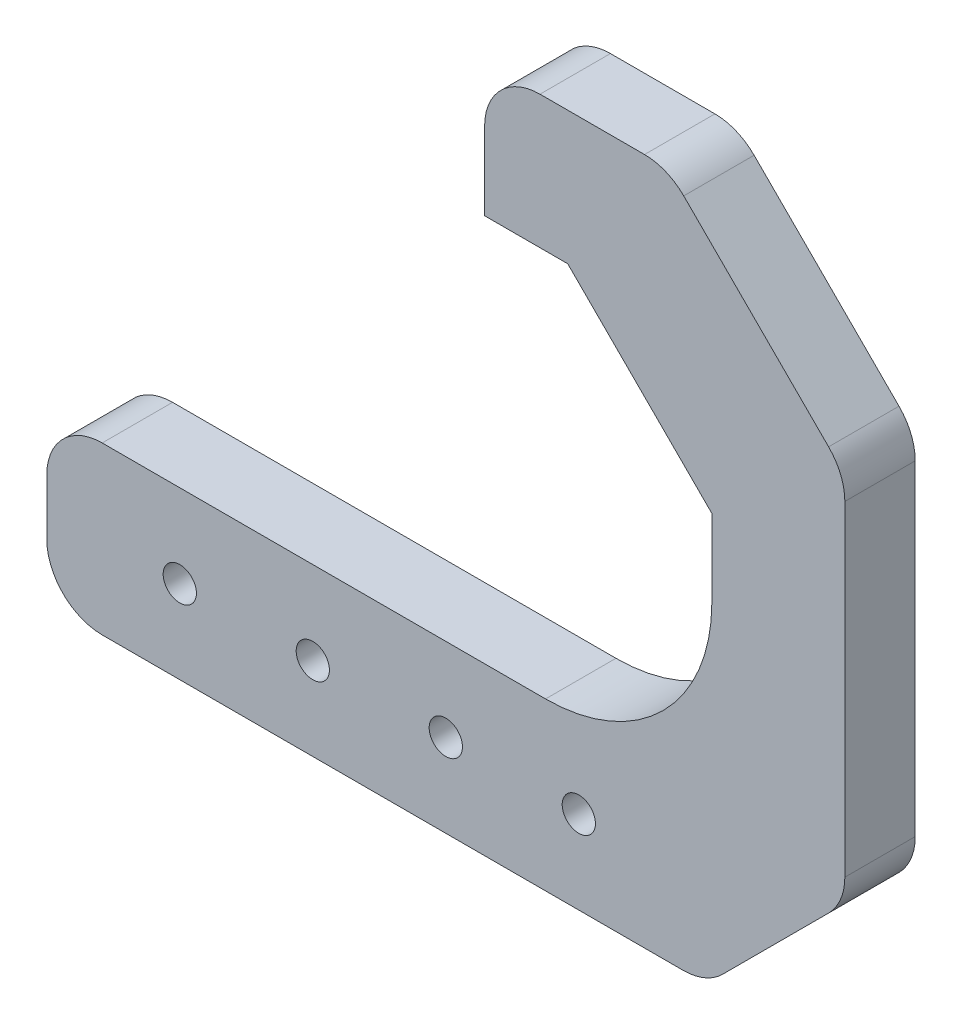
ISO-10303-21;
HEADER;
FILE_DESCRIPTION(('STEP AP214'),'2;1');
FILE_NAME('part.step','',(''),(''),'','','');
FILE_SCHEMA(('AUTOMOTIVE_DESIGN { 1 0 10303 214 1 1 1 1 }'));
ENDSEC;
DATA;
#1=APPLICATION_CONTEXT('core data for automotive mechanical design processes');
#2=APPLICATION_PROTOCOL_DEFINITION('international standard','automotive_design',2000,#1);
#3=PRODUCT_CONTEXT('',#1,'mechanical');
#4=PRODUCT('Part','Part','',(#3));
#5=PRODUCT_RELATED_PRODUCT_CATEGORY('part','',(#4));
#6=PRODUCT_DEFINITION_FORMATION('','',#4);
#7=PRODUCT_DEFINITION_CONTEXT('part definition',#1,'design');
#8=PRODUCT_DEFINITION('design','',#6,#7);
#9=PRODUCT_DEFINITION_SHAPE('','',#8);
#10=(LENGTH_UNIT() NAMED_UNIT(*) SI_UNIT(.MILLI.,.METRE.));
#11=(NAMED_UNIT(*) PLANE_ANGLE_UNIT() SI_UNIT($,.RADIAN.));
#12=(NAMED_UNIT(*) SI_UNIT($,.STERADIAN.) SOLID_ANGLE_UNIT());
#13=UNCERTAINTY_MEASURE_WITH_UNIT(LENGTH_MEASURE(1.E-05),#10,'distance_accuracy_value','');
#14=(GEOMETRIC_REPRESENTATION_CONTEXT(3) GLOBAL_UNCERTAINTY_ASSIGNED_CONTEXT((#13)) GLOBAL_UNIT_ASSIGNED_CONTEXT((#10,
#11,#12)) REPRESENTATION_CONTEXT('',''));
#15=CARTESIAN_POINT('',(0.,0.,0.));
#16=DIRECTION('',(0.,0.,1.));
#17=DIRECTION('',(1.,0.,0.));
#18=AXIS2_PLACEMENT_3D('',#15,#16,#17);
#19=CARTESIAN_POINT('',(0.,0.,6.35));
#20=DIRECTION('',(0.,1.,0.));
#21=DIRECTION('',(0.,0.,1.));
#22=AXIS2_PLACEMENT_3D('',#19,#20,#21);
#23=PLANE('',#22);
#24=DIRECTION('',(1.,0.,0.));
#25=VECTOR('',#24,1.);
#26=CARTESIAN_POINT('',(0.,0.,6.35));
#27=LINE('',#26,#25);
#28=CARTESIAN_POINT('',(5.,0.,6.35));
#29=VERTEX_POINT('',#28);
#30=CARTESIAN_POINT('',(57.4289321881345,0.,6.35));
#31=VERTEX_POINT('',#30);
#32=EDGE_CURVE('E392',#29,#31,#27,.T.);
#33=ORIENTED_EDGE('',*,*,#32,.F.);
#34=DIRECTION('',(0.,0.,-1.));
#35=VECTOR('',#34,1.);
#36=CARTESIAN_POINT('',(5.,0.,0.));
#37=LINE('',#36,#35);
#38=CARTESIAN_POINT('',(5.,0.,0.));
#39=VERTEX_POINT('',#38);
#40=EDGE_CURVE('E11',#29,#39,#37,.T.);
#41=ORIENTED_EDGE('',*,*,#40,.T.);
#42=DIRECTION('',(1.,0.,0.));
#43=VECTOR('',#42,1.);
#44=CARTESIAN_POINT('',(0.,0.,0.));
#45=LINE('',#44,#43);
#46=CARTESIAN_POINT('',(57.4289321881345,0.,0.));
#47=VERTEX_POINT('',#46);
#48=EDGE_CURVE('E220',#39,#47,#45,.T.);
#49=ORIENTED_EDGE('',*,*,#48,.T.);
#50=DIRECTION('',(0.,0.,-1.));
#51=VECTOR('',#50,1.);
#52=CARTESIAN_POINT('',(57.4289321881345,0.,6.35));
#53=LINE('',#52,#51);
#54=EDGE_CURVE('E277',#47,#31,#53,.F.);
#55=ORIENTED_EDGE('',*,*,#54,.T.);
#56=EDGE_LOOP('',(#33,#41,#49,#55));
#57=FACE_BOUND('',#56,.T.);
#58=ADVANCED_FACE('F37',(#57),#23,.F.);
#59=CARTESIAN_POINT('',(72.,0.,6.35));
#60=DIRECTION('',(-1.,0.,0.));
#61=DIRECTION('',(0.,0.,1.));
#62=AXIS2_PLACEMENT_3D('',#59,#60,#61);
#63=PLANE('',#62);
#64=DIRECTION('',(0.,1.,0.));
#65=VECTOR('',#64,1.);
#66=CARTESIAN_POINT('',(72.,0.,6.35));
#67=LINE('',#66,#65);
#68=CARTESIAN_POINT('',(72.,14.5710678118655,6.35));
#69=VERTEX_POINT('',#68);
#70=CARTESIAN_POINT('',(72.,43.9289321881345,6.35));
#71=VERTEX_POINT('',#70);
#72=EDGE_CURVE('E198',#69,#71,#67,.T.);
#73=ORIENTED_EDGE('',*,*,#72,.F.);
#74=DIRECTION('',(0.,0.,1.));
#75=VECTOR('',#74,1.);
#76=CARTESIAN_POINT('',(72.,14.5710678118655,0.));
#77=LINE('',#76,#75);
#78=CARTESIAN_POINT('',(72.,14.5710678118655,0.));
#79=VERTEX_POINT('',#78);
#80=EDGE_CURVE('E304',#69,#79,#77,.F.);
#81=ORIENTED_EDGE('',*,*,#80,.T.);
#82=DIRECTION('',(0.,1.,0.));
#83=VECTOR('',#82,1.);
#84=CARTESIAN_POINT('',(72.,0.,0.));
#85=LINE('',#84,#83);
#86=CARTESIAN_POINT('',(72.,43.9289321881345,0.));
#87=VERTEX_POINT('',#86);
#88=EDGE_CURVE('E222',#79,#87,#85,.T.);
#89=ORIENTED_EDGE('',*,*,#88,.T.);
#90=DIRECTION('',(0.,0.,-1.));
#91=VECTOR('',#90,1.);
#92=CARTESIAN_POINT('',(72.,43.9289321881345,6.35));
#93=LINE('',#92,#91);
#94=EDGE_CURVE('E301',#87,#71,#93,.F.);
#95=ORIENTED_EDGE('',*,*,#94,.T.);
#96=EDGE_LOOP('',(#73,#81,#89,#95));
#97=FACE_BOUND('',#96,.T.);
#98=ADVANCED_FACE('F372',(#97),#63,.F.);
#99=CARTESIAN_POINT('',(0.,62.,6.35));
#100=DIRECTION('',(0.,-1.,0.));
#101=DIRECTION('',(1.,0.,0.));
#102=AXIS2_PLACEMENT_3D('',#99,#100,#101);
#103=PLANE('',#102);
#104=DIRECTION('',(-1.,0.,0.));
#105=VECTOR('',#104,1.);
#106=CARTESIAN_POINT('',(0.,62.,6.35));
#107=LINE('',#106,#105);
#108=CARTESIAN_POINT('',(53.9289321881345,62.,6.35));
#109=VERTEX_POINT('',#108);
#110=CARTESIAN_POINT('',(44.5,62.,6.35));
#111=VERTEX_POINT('',#110);
#112=EDGE_CURVE('E196',#109,#111,#107,.T.);
#113=ORIENTED_EDGE('',*,*,#112,.F.);
#114=DIRECTION('',(0.,0.,1.));
#115=VECTOR('',#114,1.);
#116=CARTESIAN_POINT('',(53.9289321881345,62.,0.));
#117=LINE('',#116,#115);
#118=CARTESIAN_POINT('',(53.9289321881345,62.,0.));
#119=VERTEX_POINT('',#118);
#120=EDGE_CURVE('E311',#109,#119,#117,.F.);
#121=ORIENTED_EDGE('',*,*,#120,.T.);
#122=DIRECTION('',(-1.,0.,0.));
#123=VECTOR('',#122,1.);
#124=CARTESIAN_POINT('',(0.,62.,0.));
#125=LINE('',#124,#123);
#126=CARTESIAN_POINT('',(44.5,62.,0.));
#127=VERTEX_POINT('',#126);
#128=EDGE_CURVE('E225',#119,#127,#125,.T.);
#129=ORIENTED_EDGE('',*,*,#128,.T.);
#130=DIRECTION('',(0.,0.,-1.));
#131=VECTOR('',#130,1.);
#132=CARTESIAN_POINT('',(44.5,62.,6.35));
#133=LINE('',#132,#131);
#134=EDGE_CURVE('E261',#127,#111,#133,.F.);
#135=ORIENTED_EDGE('',*,*,#134,.T.);
#136=EDGE_LOOP('',(#113,#121,#129,#135));
#137=FACE_BOUND('',#136,.T.);
#138=ADVANCED_FACE('F354',(#137),#103,.F.);
#139=CARTESIAN_POINT('',(39.5,0.,6.35));
#140=DIRECTION('',(-1.,0.,0.));
#141=DIRECTION('',(0.,0.,1.));
#142=AXIS2_PLACEMENT_3D('',#139,#140,#141);
#143=PLANE('',#142);
#144=DIRECTION('',(0.,1.,0.));
#145=VECTOR('',#144,1.);
#146=CARTESIAN_POINT('',(39.5,0.,6.35));
#147=LINE('',#146,#145);
#148=CARTESIAN_POINT('',(39.5,50.,6.35));
#149=VERTEX_POINT('',#148);
#150=CARTESIAN_POINT('',(39.5,57.,6.35));
#151=VERTEX_POINT('',#150);
#152=EDGE_CURVE('E181',#149,#151,#147,.T.);
#153=ORIENTED_EDGE('',*,*,#152,.T.);
#154=DIRECTION('',(0.,0.,-1.));
#155=VECTOR('',#154,1.);
#156=CARTESIAN_POINT('',(39.5,57.,0.));
#157=LINE('',#156,#155);
#158=CARTESIAN_POINT('',(39.5,57.,0.));
#159=VERTEX_POINT('',#158);
#160=EDGE_CURVE('E256',#151,#159,#157,.T.);
#161=ORIENTED_EDGE('',*,*,#160,.T.);
#162=DIRECTION('',(0.,1.,0.));
#163=VECTOR('',#162,1.);
#164=CARTESIAN_POINT('',(39.5,0.,0.));
#165=LINE('',#164,#163);
#166=CARTESIAN_POINT('',(39.5,50.,0.));
#167=VERTEX_POINT('',#166);
#168=EDGE_CURVE('E189',#167,#159,#165,.T.);
#169=ORIENTED_EDGE('',*,*,#168,.F.);
#170=DIRECTION('',(0.,0.,-1.));
#171=VECTOR('',#170,1.);
#172=CARTESIAN_POINT('',(39.5,50.,6.35));
#173=LINE('',#172,#171);
#174=EDGE_CURVE('E174',#149,#167,#173,.T.);
#175=ORIENTED_EDGE('',*,*,#174,.F.);
#176=EDGE_LOOP('',(#153,#161,#169,#175));
#177=FACE_BOUND('',#176,.T.);
#178=ADVANCED_FACE('F185',(#177),#143,.T.);
#179=CARTESIAN_POINT('',(0.,50.,6.35));
#180=DIRECTION('',(0.,-1.,0.));
#181=DIRECTION('',(1.,0.,0.));
#182=AXIS2_PLACEMENT_3D('',#179,#180,#181);
#183=PLANE('',#182);
#184=DIRECTION('',(-1.,0.,0.));
#185=VECTOR('',#184,1.);
#186=CARTESIAN_POINT('',(0.,50.,0.));
#187=LINE('',#186,#185);
#188=CARTESIAN_POINT('',(47.0000000000001,50.,0.));
#189=VERTEX_POINT('',#188);
#190=EDGE_CURVE('E228',#189,#167,#187,.T.);
#191=ORIENTED_EDGE('',*,*,#190,.F.);
#192=DIRECTION('',(0.,0.,1.));
#193=VECTOR('',#192,1.);
#194=CARTESIAN_POINT('',(47.0000000000001,50.,6.35));
#195=LINE('',#194,#193);
#196=CARTESIAN_POINT('',(47.0000000000001,50.,6.35));
#197=VERTEX_POINT('',#196);
#198=EDGE_CURVE('E177',#189,#197,#195,.T.);
#199=ORIENTED_EDGE('',*,*,#198,.T.);
#200=DIRECTION('',(-1.,0.,0.));
#201=VECTOR('',#200,1.);
#202=CARTESIAN_POINT('',(0.,50.,6.35));
#203=LINE('',#202,#201);
#204=EDGE_CURVE('E170',#197,#149,#203,.T.);
#205=ORIENTED_EDGE('',*,*,#204,.T.);
#206=ORIENTED_EDGE('',*,*,#174,.T.);
#207=EDGE_LOOP('',(#191,#199,#205,#206));
#208=FACE_BOUND('',#207,.T.);
#209=ADVANCED_FACE('F173',(#208),#183,.T.);
#210=CARTESIAN_POINT('',(60.,0.,6.35));
#211=DIRECTION('',(-1.,0.,0.));
#212=DIRECTION('',(0.,0.,1.));
#213=AXIS2_PLACEMENT_3D('',#210,#211,#212);
#214=PLANE('',#213);
#215=DIRECTION('',(0.,1.,0.));
#216=VECTOR('',#215,1.);
#217=CARTESIAN_POINT('',(60.,0.,6.35));
#218=LINE('',#217,#216);
#219=CARTESIAN_POINT('',(60.,30.,6.35));
#220=VERTEX_POINT('',#219);
#221=CARTESIAN_POINT('',(60.,36.9999999999999,6.35));
#222=VERTEX_POINT('',#221);
#223=EDGE_CURVE('E180',#220,#222,#218,.T.);
#224=ORIENTED_EDGE('',*,*,#223,.T.);
#225=DIRECTION('',(0.,0.,-1.));
#226=VECTOR('',#225,1.);
#227=CARTESIAN_POINT('',(60.,36.9999999999999,0.));
#228=LINE('',#227,#226);
#229=CARTESIAN_POINT('',(60.,36.9999999999999,0.));
#230=VERTEX_POINT('',#229);
#231=EDGE_CURVE('E248',#222,#230,#228,.T.);
#232=ORIENTED_EDGE('',*,*,#231,.T.);
#233=DIRECTION('',(0.,1.,0.));
#234=VECTOR('',#233,1.);
#235=CARTESIAN_POINT('',(60.,0.,0.));
#236=LINE('',#235,#234);
#237=CARTESIAN_POINT('',(60.,30.,0.));
#238=VERTEX_POINT('',#237);
#239=EDGE_CURVE('E230',#238,#230,#236,.T.);
#240=ORIENTED_EDGE('',*,*,#239,.F.);
#241=DIRECTION('',(0.,0.,-1.));
#242=VECTOR('',#241,1.);
#243=CARTESIAN_POINT('',(60.,30.,6.35));
#244=LINE('',#243,#242);
#245=EDGE_CURVE('E241',#238,#220,#244,.F.);
#246=ORIENTED_EDGE('',*,*,#245,.T.);
#247=EDGE_LOOP('',(#224,#232,#240,#246));
#248=FACE_BOUND('',#247,.T.);
#249=ADVANCED_FACE('F343',(#248),#214,.T.);
#250=CARTESIAN_POINT('',(0.,15.,6.35));
#251=DIRECTION('',(0.,1.,0.));
#252=DIRECTION('',(0.,0.,1.));
#253=AXIS2_PLACEMENT_3D('',#250,#251,#252);
#254=PLANE('',#253);
#255=DIRECTION('',(1.,0.,0.));
#256=VECTOR('',#255,1.);
#257=CARTESIAN_POINT('',(0.,15.,0.));
#258=LINE('',#257,#256);
#259=CARTESIAN_POINT('',(5.,15.,0.));
#260=VERTEX_POINT('',#259);
#261=CARTESIAN_POINT('',(45.,15.,0.));
#262=VERTEX_POINT('',#261);
#263=EDGE_CURVE('E233',#260,#262,#258,.T.);
#264=ORIENTED_EDGE('',*,*,#263,.F.);
#265=DIRECTION('',(0.,0.,-1.));
#266=VECTOR('',#265,1.);
#267=CARTESIAN_POINT('',(5.,15.,6.35));
#268=LINE('',#267,#266);
#269=CARTESIAN_POINT('',(5.,15.,6.35));
#270=VERTEX_POINT('',#269);
#271=EDGE_CURVE('E60',#260,#270,#268,.F.);
#272=ORIENTED_EDGE('',*,*,#271,.T.);
#273=DIRECTION('',(1.,0.,0.));
#274=VECTOR('',#273,1.);
#275=CARTESIAN_POINT('',(0.,15.,6.35));
#276=LINE('',#275,#274);
#277=CARTESIAN_POINT('',(45.,15.,6.35));
#278=VERTEX_POINT('',#277);
#279=EDGE_CURVE('E204',#270,#278,#276,.T.);
#280=ORIENTED_EDGE('',*,*,#279,.T.);
#281=DIRECTION('',(0.,0.,-1.));
#282=VECTOR('',#281,1.);
#283=CARTESIAN_POINT('',(45.,15.,0.));
#284=LINE('',#283,#282);
#285=EDGE_CURVE('E190',#278,#262,#284,.T.);
#286=ORIENTED_EDGE('',*,*,#285,.T.);
#287=EDGE_LOOP('',(#264,#272,#280,#286));
#288=FACE_BOUND('',#287,.T.);
#289=ADVANCED_FACE('F335',(#288),#254,.T.);
#290=CARTESIAN_POINT('',(48.,7.5,6.35));
#291=DIRECTION('',(0.,0.,-1.));
#292=DIRECTION('',(-1.,0.,0.));
#293=AXIS2_PLACEMENT_3D('',#290,#291,#292);
#294=CYLINDRICAL_SURFACE('',#293,1.5);
#295=CARTESIAN_POINT('',(48.,7.5,6.35));
#296=DIRECTION('',(0.,0.,1.));
#297=DIRECTION('',(1.,0.,0.));
#298=AXIS2_PLACEMENT_3D('',#295,#296,#297);
#299=CIRCLE('',#298,1.5);
#300=CARTESIAN_POINT('',(49.5,7.5,6.35));
#301=VERTEX_POINT('',#300);
#302=EDGE_CURVE('E639',#301,#301,#299,.T.);
#303=ORIENTED_EDGE('',*,*,#302,.T.);
#304=EDGE_LOOP('',(#303));
#305=FACE_BOUND('',#304,.T.);
#306=CARTESIAN_POINT('',(48.,7.5,0.));
#307=DIRECTION('',(0.,0.,1.));
#308=DIRECTION('',(1.,0.,0.));
#309=AXIS2_PLACEMENT_3D('',#306,#307,#308);
#310=CIRCLE('',#309,1.5);
#311=CARTESIAN_POINT('',(49.5,7.5,0.));
#312=VERTEX_POINT('',#311);
#313=EDGE_CURVE('E217',#312,#312,#310,.T.);
#314=ORIENTED_EDGE('',*,*,#313,.F.);
#315=EDGE_LOOP('',(#314));
#316=FACE_BOUND('',#315,.T.);
#317=ADVANCED_FACE('F406',(#305,#316),#294,.F.);
#318=CARTESIAN_POINT('',(36.,7.49999999999992,6.35));
#319=DIRECTION('',(0.,0.,-1.));
#320=DIRECTION('',(-1.,0.,0.));
#321=AXIS2_PLACEMENT_3D('',#318,#319,#320);
#322=CYLINDRICAL_SURFACE('',#321,1.5);
#323=CARTESIAN_POINT('',(36.,7.49999999999992,6.35));
#324=DIRECTION('',(0.,0.,1.));
#325=DIRECTION('',(1.,0.,0.));
#326=AXIS2_PLACEMENT_3D('',#323,#324,#325);
#327=CIRCLE('',#326,1.5);
#328=CARTESIAN_POINT('',(37.5,7.49999999999992,6.35));
#329=VERTEX_POINT('',#328);
#330=EDGE_CURVE('E636',#329,#329,#327,.T.);
#331=ORIENTED_EDGE('',*,*,#330,.T.);
#332=EDGE_LOOP('',(#331));
#333=FACE_BOUND('',#332,.T.);
#334=CARTESIAN_POINT('',(36.,7.49999999999992,0.));
#335=DIRECTION('',(0.,0.,1.));
#336=DIRECTION('',(1.,0.,0.));
#337=AXIS2_PLACEMENT_3D('',#334,#335,#336);
#338=CIRCLE('',#337,1.5);
#339=CARTESIAN_POINT('',(37.5,7.49999999999992,0.));
#340=VERTEX_POINT('',#339);
#341=EDGE_CURVE('E214',#340,#340,#338,.T.);
#342=ORIENTED_EDGE('',*,*,#341,.F.);
#343=EDGE_LOOP('',(#342));
#344=FACE_BOUND('',#343,.T.);
#345=ADVANCED_FACE('F409',(#333,#344),#322,.F.);
#346=CARTESIAN_POINT('',(24.,7.49999999999983,6.35));
#347=DIRECTION('',(0.,0.,-1.));
#348=DIRECTION('',(-1.,0.,0.));
#349=AXIS2_PLACEMENT_3D('',#346,#347,#348);
#350=CYLINDRICAL_SURFACE('',#349,1.5);
#351=CARTESIAN_POINT('',(24.,7.49999999999983,6.35));
#352=DIRECTION('',(0.,0.,1.));
#353=DIRECTION('',(1.,0.,0.));
#354=AXIS2_PLACEMENT_3D('',#351,#352,#353);
#355=CIRCLE('',#354,1.5);
#356=CARTESIAN_POINT('',(25.5,7.49999999999983,6.35));
#357=VERTEX_POINT('',#356);
#358=EDGE_CURVE('E632',#357,#357,#355,.T.);
#359=ORIENTED_EDGE('',*,*,#358,.T.);
#360=EDGE_LOOP('',(#359));
#361=FACE_BOUND('',#360,.T.);
#362=CARTESIAN_POINT('',(24.,7.49999999999983,0.));
#363=DIRECTION('',(0.,0.,1.));
#364=DIRECTION('',(1.,0.,0.));
#365=AXIS2_PLACEMENT_3D('',#362,#363,#364);
#366=CIRCLE('',#365,1.5);
#367=CARTESIAN_POINT('',(25.5,7.49999999999983,0.));
#368=VERTEX_POINT('',#367);
#369=EDGE_CURVE('E211',#368,#368,#366,.T.);
#370=ORIENTED_EDGE('',*,*,#369,.F.);
#371=EDGE_LOOP('',(#370));
#372=FACE_BOUND('',#371,.T.);
#373=ADVANCED_FACE('F413',(#361,#372),#350,.F.);
#374=CARTESIAN_POINT('',(12.,7.49999999999975,6.35));
#375=DIRECTION('',(0.,0.,-1.));
#376=DIRECTION('',(-1.,0.,0.));
#377=AXIS2_PLACEMENT_3D('',#374,#375,#376);
#378=CYLINDRICAL_SURFACE('',#377,1.5);
#379=CARTESIAN_POINT('',(12.,7.49999999999975,6.35));
#380=DIRECTION('',(0.,0.,1.));
#381=DIRECTION('',(1.,0.,0.));
#382=AXIS2_PLACEMENT_3D('',#379,#380,#381);
#383=CIRCLE('',#382,1.5);
#384=CARTESIAN_POINT('',(13.5,7.49999999999975,6.35));
#385=VERTEX_POINT('',#384);
#386=EDGE_CURVE('E237',#385,#385,#383,.T.);
#387=ORIENTED_EDGE('',*,*,#386,.T.);
#388=EDGE_LOOP('',(#387));
#389=FACE_BOUND('',#388,.T.);
#390=CARTESIAN_POINT('',(12.,7.49999999999975,0.));
#391=DIRECTION('',(0.,0.,1.));
#392=DIRECTION('',(1.,0.,0.));
#393=AXIS2_PLACEMENT_3D('',#390,#391,#392);
#394=CIRCLE('',#393,1.5);
#395=CARTESIAN_POINT('',(13.5,7.49999999999975,0.));
#396=VERTEX_POINT('',#395);
#397=EDGE_CURVE('E208',#396,#396,#394,.T.);
#398=ORIENTED_EDGE('',*,*,#397,.F.);
#399=EDGE_LOOP('',(#398));
#400=FACE_BOUND('',#399,.T.);
#401=ADVANCED_FACE('F417',(#389,#400),#378,.F.);
#402=CARTESIAN_POINT('',(0.,0.,6.35));
#403=DIRECTION('',(-1.,0.,0.));
#404=DIRECTION('',(0.,0.,1.));
#405=AXIS2_PLACEMENT_3D('',#402,#403,#404);
#406=PLANE('',#405);
#407=DIRECTION('',(0.,1.,0.));
#408=VECTOR('',#407,1.);
#409=CARTESIAN_POINT('',(0.,0.,6.35));
#410=LINE('',#409,#408);
#411=CARTESIAN_POINT('',(0.,5.,6.35));
#412=VERTEX_POINT('',#411);
#413=CARTESIAN_POINT('',(0.,10.,6.35));
#414=VERTEX_POINT('',#413);
#415=EDGE_CURVE('E191',#412,#414,#410,.T.);
#416=ORIENTED_EDGE('',*,*,#415,.T.);
#417=DIRECTION('',(0.,0.,-1.));
#418=VECTOR('',#417,1.);
#419=CARTESIAN_POINT('',(0.,10.,6.35));
#420=LINE('',#419,#418);
#421=CARTESIAN_POINT('',(0.,10.,0.));
#422=VERTEX_POINT('',#421);
#423=EDGE_CURVE('E316',#414,#422,#420,.T.);
#424=ORIENTED_EDGE('',*,*,#423,.T.);
#425=DIRECTION('',(0.,1.,0.));
#426=VECTOR('',#425,1.);
#427=CARTESIAN_POINT('',(0.,0.,0.));
#428=LINE('',#427,#426);
#429=CARTESIAN_POINT('',(0.,5.,0.));
#430=VERTEX_POINT('',#429);
#431=EDGE_CURVE('E235',#430,#422,#428,.T.);
#432=ORIENTED_EDGE('',*,*,#431,.F.);
#433=DIRECTION('',(0.,0.,-1.));
#434=VECTOR('',#433,1.);
#435=CARTESIAN_POINT('',(0.,5.,6.35));
#436=LINE('',#435,#434);
#437=EDGE_CURVE('E314',#430,#412,#436,.F.);
#438=ORIENTED_EDGE('',*,*,#437,.T.);
#439=EDGE_LOOP('',(#416,#424,#432,#438));
#440=FACE_BOUND('',#439,.T.);
#441=ADVANCED_FACE('F328',(#440),#406,.T.);
#442=CARTESIAN_POINT('',(0.,0.,6.35));
#443=DIRECTION('',(0.,0.,1.));
#444=DIRECTION('',(1.,0.,0.));
#445=AXIS2_PLACEMENT_3D('',#442,#443,#444);
#446=PLANE('',#445);
#447=ORIENTED_EDGE('',*,*,#386,.F.);
#448=EDGE_LOOP('',(#447));
#449=FACE_BOUND('',#448,.T.);
#450=ORIENTED_EDGE('',*,*,#358,.F.);
#451=EDGE_LOOP('',(#450));
#452=FACE_BOUND('',#451,.T.);
#453=ORIENTED_EDGE('',*,*,#330,.F.);
#454=EDGE_LOOP('',(#453));
#455=FACE_BOUND('',#454,.T.);
#456=ORIENTED_EDGE('',*,*,#302,.F.);
#457=EDGE_LOOP('',(#456));
#458=FACE_BOUND('',#457,.T.);
#459=ORIENTED_EDGE('',*,*,#279,.F.);
#460=CARTESIAN_POINT('',(5.,10.,6.35));
#461=DIRECTION('',(0.,0.,1.));
#462=DIRECTION('',(1.,0.,0.));
#463=AXIS2_PLACEMENT_3D('',#460,#461,#462);
#464=CIRCLE('',#463,5.);
#465=EDGE_CURVE('E45',#270,#414,#464,.T.);
#466=ORIENTED_EDGE('',*,*,#465,.T.);
#467=ORIENTED_EDGE('',*,*,#415,.F.);
#468=CARTESIAN_POINT('',(5.,5.,6.35));
#469=DIRECTION('',(0.,0.,1.));
#470=DIRECTION('',(1.,0.,0.));
#471=AXIS2_PLACEMENT_3D('',#468,#469,#470);
#472=CIRCLE('',#471,5.);
#473=EDGE_CURVE('E52',#412,#29,#472,.T.);
#474=ORIENTED_EDGE('',*,*,#473,.T.);
#475=ORIENTED_EDGE('',*,*,#32,.T.);
#476=CARTESIAN_POINT('',(57.4289321881345,5.,6.35));
#477=DIRECTION('',(0.,0.,1.));
#478=DIRECTION('',(1.,0.,0.));
#479=AXIS2_PLACEMENT_3D('',#476,#477,#478);
#480=CIRCLE('',#479,5.);
#481=CARTESIAN_POINT('',(60.9644660940672,1.46446609406726,6.35));
#482=VERTEX_POINT('',#481);
#483=EDGE_CURVE('E286',#31,#482,#480,.T.);
#484=ORIENTED_EDGE('',*,*,#483,.T.);
#485=DIRECTION('',(-0.707106781186549,-0.707106781186546,0.));
#486=VECTOR('',#485,1.);
#487=CARTESIAN_POINT('',(29.7499999999999,-29.75,6.35));
#488=LINE('',#487,#486);
#489=CARTESIAN_POINT('',(70.5355339059327,11.0355339059327,6.35));
#490=VERTEX_POINT('',#489);
#491=EDGE_CURVE('E268',#482,#490,#488,.F.);
#492=ORIENTED_EDGE('',*,*,#491,.T.);
#493=CARTESIAN_POINT('',(67.,14.5710678118655,6.35));
#494=DIRECTION('',(0.,0.,1.));
#495=DIRECTION('',(1.,0.,0.));
#496=AXIS2_PLACEMENT_3D('',#493,#494,#495);
#497=CIRCLE('',#496,5.);
#498=EDGE_CURVE('E284',#490,#69,#497,.T.);
#499=ORIENTED_EDGE('',*,*,#498,.T.);
#500=ORIENTED_EDGE('',*,*,#72,.T.);
#501=CARTESIAN_POINT('',(67.,43.9289321881345,6.35));
#502=DIRECTION('',(0.,0.,1.));
#503=DIRECTION('',(1.,0.,0.));
#504=AXIS2_PLACEMENT_3D('',#501,#502,#503);
#505=CIRCLE('',#504,5.);
#506=CARTESIAN_POINT('',(70.5355339059327,47.4644660940672,6.35));
#507=VERTEX_POINT('',#506);
#508=EDGE_CURVE('E282',#71,#507,#505,.T.);
#509=ORIENTED_EDGE('',*,*,#508,.T.);
#510=DIRECTION('',(0.707106781186546,-0.707106781186549,0.));
#511=VECTOR('',#510,1.);
#512=CARTESIAN_POINT('',(59.0000000000001,58.9999999999999,6.35));
#513=LINE('',#512,#511);
#514=CARTESIAN_POINT('',(57.4644660940673,60.5355339059327,6.35));
#515=VERTEX_POINT('',#514);
#516=EDGE_CURVE('E274',#507,#515,#513,.F.);
#517=ORIENTED_EDGE('',*,*,#516,.T.);
#518=CARTESIAN_POINT('',(53.9289321881345,57.,6.35));
#519=DIRECTION('',(0.,0.,1.));
#520=DIRECTION('',(1.,0.,0.));
#521=AXIS2_PLACEMENT_3D('',#518,#519,#520);
#522=CIRCLE('',#521,5.);
#523=EDGE_CURVE('E280',#515,#109,#522,.T.);
#524=ORIENTED_EDGE('',*,*,#523,.T.);
#525=ORIENTED_EDGE('',*,*,#112,.T.);
#526=CARTESIAN_POINT('',(44.5,57.,6.35));
#527=DIRECTION('',(0.,0.,1.));
#528=DIRECTION('',(1.,0.,0.));
#529=AXIS2_PLACEMENT_3D('',#526,#527,#528);
#530=CIRCLE('',#529,5.);
#531=EDGE_CURVE('E195',#111,#151,#530,.T.);
#532=ORIENTED_EDGE('',*,*,#531,.T.);
#533=ORIENTED_EDGE('',*,*,#152,.F.);
#534=ORIENTED_EDGE('',*,*,#204,.F.);
#535=DIRECTION('',(-0.707106781186544,0.707106781186551,0.));
#536=VECTOR('',#535,1.);
#537=CARTESIAN_POINT('',(60.,36.9999999999999,6.35));
#538=LINE('',#537,#536);
#539=EDGE_CURVE('E254',#197,#222,#538,.F.);
#540=ORIENTED_EDGE('',*,*,#539,.T.);
#541=ORIENTED_EDGE('',*,*,#223,.F.);
#542=CARTESIAN_POINT('',(45.,30.,6.35));
#543=DIRECTION('',(0.,0.,1.));
#544=DIRECTION('',(1.,0.,0.));
#545=AXIS2_PLACEMENT_3D('',#542,#543,#544);
#546=CIRCLE('',#545,15.);
#547=EDGE_CURVE('E245',#220,#278,#546,.F.);
#548=ORIENTED_EDGE('',*,*,#547,.T.);
#549=EDGE_LOOP('',(#459,#466,#467,#474,#475,#484,#492,#499,#500,#509,#517,#524,#525,#532,#533,
#534,#540,#541,#548));
#550=FACE_BOUND('',#549,.T.);
#551=ADVANCED_FACE('F193',(#449,#452,#455,#458,#550),#446,.T.);
#552=CARTESIAN_POINT('',(0.,0.,0.));
#553=DIRECTION('',(0.,0.,1.));
#554=DIRECTION('',(1.,0.,0.));
#555=AXIS2_PLACEMENT_3D('',#552,#553,#554);
#556=PLANE('',#555);
#557=ORIENTED_EDGE('',*,*,#397,.T.);
#558=EDGE_LOOP('',(#557));
#559=FACE_BOUND('',#558,.T.);
#560=ORIENTED_EDGE('',*,*,#369,.T.);
#561=EDGE_LOOP('',(#560));
#562=FACE_BOUND('',#561,.T.);
#563=ORIENTED_EDGE('',*,*,#341,.T.);
#564=EDGE_LOOP('',(#563));
#565=FACE_BOUND('',#564,.T.);
#566=ORIENTED_EDGE('',*,*,#313,.T.);
#567=EDGE_LOOP('',(#566));
#568=FACE_BOUND('',#567,.T.);
#569=ORIENTED_EDGE('',*,*,#431,.T.);
#570=CARTESIAN_POINT('',(5.,10.,0.));
#571=DIRECTION('',(0.,0.,1.));
#572=DIRECTION('',(1.,0.,0.));
#573=AXIS2_PLACEMENT_3D('',#570,#571,#572);
#574=CIRCLE('',#573,5.);
#575=EDGE_CURVE('E321',#422,#260,#574,.F.);
#576=ORIENTED_EDGE('',*,*,#575,.T.);
#577=ORIENTED_EDGE('',*,*,#263,.T.);
#578=CARTESIAN_POINT('',(45.,30.,0.));
#579=DIRECTION('',(0.,0.,1.));
#580=DIRECTION('',(1.,0.,0.));
#581=AXIS2_PLACEMENT_3D('',#578,#579,#580);
#582=CIRCLE('',#581,15.);
#583=EDGE_CURVE('E243',#262,#238,#582,.T.);
#584=ORIENTED_EDGE('',*,*,#583,.T.);
#585=ORIENTED_EDGE('',*,*,#239,.T.);
#586=DIRECTION('',(0.707106781186544,-0.707106781186551,0.));
#587=VECTOR('',#586,1.);
#588=CARTESIAN_POINT('',(48.5000000000003,48.4999999999998,0.));
#589=LINE('',#588,#587);
#590=EDGE_CURVE('E252',#230,#189,#589,.F.);
#591=ORIENTED_EDGE('',*,*,#590,.T.);
#592=ORIENTED_EDGE('',*,*,#190,.T.);
#593=ORIENTED_EDGE('',*,*,#168,.T.);
#594=CARTESIAN_POINT('',(44.5,57.,0.));
#595=DIRECTION('',(0.,0.,1.));
#596=DIRECTION('',(1.,0.,0.));
#597=AXIS2_PLACEMENT_3D('',#594,#595,#596);
#598=CIRCLE('',#597,5.);
#599=EDGE_CURVE('E258',#159,#127,#598,.F.);
#600=ORIENTED_EDGE('',*,*,#599,.T.);
#601=ORIENTED_EDGE('',*,*,#128,.F.);
#602=CARTESIAN_POINT('',(53.9289321881345,57.,0.));
#603=DIRECTION('',(0.,0.,1.));
#604=DIRECTION('',(1.,0.,0.));
#605=AXIS2_PLACEMENT_3D('',#602,#603,#604);
#606=CIRCLE('',#605,5.);
#607=CARTESIAN_POINT('',(57.4644660940673,60.5355339059327,0.));
#608=VERTEX_POINT('',#607);
#609=EDGE_CURVE('E292',#119,#608,#606,.F.);
#610=ORIENTED_EDGE('',*,*,#609,.T.);
#611=DIRECTION('',(-0.707106781186546,0.707106781186549,0.));
#612=VECTOR('',#611,1.);
#613=CARTESIAN_POINT('',(56.,62.,0.));
#614=LINE('',#613,#612);
#615=CARTESIAN_POINT('',(70.5355339059327,47.4644660940672,0.));
#616=VERTEX_POINT('',#615);
#617=EDGE_CURVE('E271',#608,#616,#614,.F.);
#618=ORIENTED_EDGE('',*,*,#617,.T.);
#619=CARTESIAN_POINT('',(67.,43.9289321881345,0.));
#620=DIRECTION('',(0.,0.,1.));
#621=DIRECTION('',(1.,0.,0.));
#622=AXIS2_PLACEMENT_3D('',#619,#620,#621);
#623=CIRCLE('',#622,5.);
#624=EDGE_CURVE('E294',#616,#87,#623,.F.);
#625=ORIENTED_EDGE('',*,*,#624,.T.);
#626=ORIENTED_EDGE('',*,*,#88,.F.);
#627=CARTESIAN_POINT('',(67.,14.5710678118655,0.));
#628=DIRECTION('',(0.,0.,1.));
#629=DIRECTION('',(1.,0.,0.));
#630=AXIS2_PLACEMENT_3D('',#627,#628,#629);
#631=CIRCLE('',#630,5.);
#632=CARTESIAN_POINT('',(70.5355339059327,11.0355339059327,0.));
#633=VERTEX_POINT('',#632);
#634=EDGE_CURVE('E296',#79,#633,#631,.F.);
#635=ORIENTED_EDGE('',*,*,#634,.T.);
#636=DIRECTION('',(0.707106781186549,0.707106781186546,0.));
#637=VECTOR('',#636,1.);
#638=CARTESIAN_POINT('',(72.,12.5,0.));
#639=LINE('',#638,#637);
#640=CARTESIAN_POINT('',(60.9644660940672,1.46446609406726,0.));
#641=VERTEX_POINT('',#640);
#642=EDGE_CURVE('E265',#633,#641,#639,.F.);
#643=ORIENTED_EDGE('',*,*,#642,.T.);
#644=CARTESIAN_POINT('',(57.4289321881345,5.,0.));
#645=DIRECTION('',(0.,0.,1.));
#646=DIRECTION('',(1.,0.,0.));
#647=AXIS2_PLACEMENT_3D('',#644,#645,#646);
#648=CIRCLE('',#647,5.);
#649=EDGE_CURVE('E298',#641,#47,#648,.F.);
#650=ORIENTED_EDGE('',*,*,#649,.T.);
#651=ORIENTED_EDGE('',*,*,#48,.F.);
#652=CARTESIAN_POINT('',(5.,5.,0.));
#653=DIRECTION('',(0.,0.,1.));
#654=DIRECTION('',(1.,0.,0.));
#655=AXIS2_PLACEMENT_3D('',#652,#653,#654);
#656=CIRCLE('',#655,5.);
#657=EDGE_CURVE('E319',#39,#430,#656,.F.);
#658=ORIENTED_EDGE('',*,*,#657,.T.);
#659=EDGE_LOOP('',(#569,#576,#577,#584,#585,#591,#592,#593,#600,#601,#610,#618,#625,#626,#635,
#643,#650,#651,#658));
#660=FACE_BOUND('',#659,.T.);
#661=ADVANCED_FACE('F333',(#559,#562,#565,#568,#660),#556,.F.);
#662=CARTESIAN_POINT('',(45.,30.,6.35));
#663=DIRECTION('',(0.,0.,1.));
#664=DIRECTION('',(1.,0.,0.));
#665=AXIS2_PLACEMENT_3D('',#662,#663,#664);
#666=CYLINDRICAL_SURFACE('',#665,15.);
#667=ORIENTED_EDGE('',*,*,#547,.F.);
#668=ORIENTED_EDGE('',*,*,#245,.F.);
#669=ORIENTED_EDGE('',*,*,#583,.F.);
#670=ORIENTED_EDGE('',*,*,#285,.F.);
#671=EDGE_LOOP('',(#667,#668,#669,#670));
#672=FACE_BOUND('',#671,.T.);
#673=ADVANCED_FACE('F339',(#672),#666,.F.);
#674=CARTESIAN_POINT('',(60.,36.9999999999999,6.35));
#675=DIRECTION('',(-0.707106781186551,-0.707106781186544,0.));
#676=DIRECTION('',(0.,0.,1.));
#677=AXIS2_PLACEMENT_3D('',#674,#675,#676);
#678=PLANE('',#677);
#679=ORIENTED_EDGE('',*,*,#539,.F.);
#680=ORIENTED_EDGE('',*,*,#198,.F.);
#681=ORIENTED_EDGE('',*,*,#590,.F.);
#682=ORIENTED_EDGE('',*,*,#231,.F.);
#683=EDGE_LOOP('',(#679,#680,#681,#682));
#684=FACE_BOUND('',#683,.T.);
#685=ADVANCED_FACE('F347',(#684),#678,.T.);
#686=CARTESIAN_POINT('',(44.5,57.,6.35));
#687=DIRECTION('',(0.,0.,1.));
#688=DIRECTION('',(1.,0.,0.));
#689=AXIS2_PLACEMENT_3D('',#686,#687,#688);
#690=CYLINDRICAL_SURFACE('',#689,5.);
#691=ORIENTED_EDGE('',*,*,#531,.F.);
#692=ORIENTED_EDGE('',*,*,#134,.F.);
#693=ORIENTED_EDGE('',*,*,#599,.F.);
#694=ORIENTED_EDGE('',*,*,#160,.F.);
#695=EDGE_LOOP('',(#691,#692,#693,#694));
#696=FACE_BOUND('',#695,.T.);
#697=ADVANCED_FACE('F351',(#696),#690,.T.);
#698=CARTESIAN_POINT('',(72.,12.5,6.35));
#699=DIRECTION('',(-0.707106781186546,0.707106781186549,0.));
#700=DIRECTION('',(0.,0.,-1.));
#701=AXIS2_PLACEMENT_3D('',#698,#699,#700);
#702=PLANE('',#701);
#703=ORIENTED_EDGE('',*,*,#491,.F.);
#704=DIRECTION('',(0.,0.,1.));
#705=VECTOR('',#704,1.);
#706=CARTESIAN_POINT('',(60.9644660940672,1.46446609406726,0.));
#707=LINE('',#706,#705);
#708=EDGE_CURVE('E290',#482,#641,#707,.F.);
#709=ORIENTED_EDGE('',*,*,#708,.T.);
#710=ORIENTED_EDGE('',*,*,#642,.F.);
#711=DIRECTION('',(0.,0.,-1.));
#712=VECTOR('',#711,1.);
#713=CARTESIAN_POINT('',(70.5355339059327,11.0355339059327,6.35));
#714=LINE('',#713,#712);
#715=EDGE_CURVE('E288',#633,#490,#714,.F.);
#716=ORIENTED_EDGE('',*,*,#715,.T.);
#717=EDGE_LOOP('',(#703,#709,#710,#716));
#718=FACE_BOUND('',#717,.T.);
#719=ADVANCED_FACE('F383',(#718),#702,.F.);
#720=CARTESIAN_POINT('',(56.,62.,6.35));
#721=DIRECTION('',(-0.707106781186549,-0.707106781186546,0.));
#722=DIRECTION('',(0.,0.,-1.));
#723=AXIS2_PLACEMENT_3D('',#720,#721,#722);
#724=PLANE('',#723);
#725=ORIENTED_EDGE('',*,*,#516,.F.);
#726=DIRECTION('',(0.,0.,1.));
#727=VECTOR('',#726,1.);
#728=CARTESIAN_POINT('',(70.5355339059327,47.4644660940672,0.));
#729=LINE('',#728,#727);
#730=EDGE_CURVE('E309',#507,#616,#729,.F.);
#731=ORIENTED_EDGE('',*,*,#730,.T.);
#732=ORIENTED_EDGE('',*,*,#617,.F.);
#733=DIRECTION('',(0.,0.,-1.));
#734=VECTOR('',#733,1.);
#735=CARTESIAN_POINT('',(57.4644660940673,60.5355339059327,6.35));
#736=LINE('',#735,#734);
#737=EDGE_CURVE('E307',#608,#515,#736,.F.);
#738=ORIENTED_EDGE('',*,*,#737,.T.);
#739=EDGE_LOOP('',(#725,#731,#732,#738));
#740=FACE_BOUND('',#739,.T.);
#741=ADVANCED_FACE('F364',(#740),#724,.F.);
#742=CARTESIAN_POINT('',(57.4289321881345,5.,6.35));
#743=DIRECTION('',(0.,0.,1.));
#744=DIRECTION('',(1.,0.,0.));
#745=AXIS2_PLACEMENT_3D('',#742,#743,#744);
#746=CYLINDRICAL_SURFACE('',#745,5.);
#747=ORIENTED_EDGE('',*,*,#649,.F.);
#748=ORIENTED_EDGE('',*,*,#708,.F.);
#749=ORIENTED_EDGE('',*,*,#483,.F.);
#750=ORIENTED_EDGE('',*,*,#54,.F.);
#751=EDGE_LOOP('',(#747,#748,#749,#750));
#752=FACE_BOUND('',#751,.T.);
#753=ADVANCED_FACE('F387',(#752),#746,.T.);
#754=CARTESIAN_POINT('',(67.,14.5710678118655,6.35));
#755=DIRECTION('',(0.,0.,-1.));
#756=DIRECTION('',(-1.,0.,0.));
#757=AXIS2_PLACEMENT_3D('',#754,#755,#756);
#758=CYLINDRICAL_SURFACE('',#757,5.);
#759=ORIENTED_EDGE('',*,*,#498,.F.);
#760=ORIENTED_EDGE('',*,*,#715,.F.);
#761=ORIENTED_EDGE('',*,*,#634,.F.);
#762=ORIENTED_EDGE('',*,*,#80,.F.);
#763=EDGE_LOOP('',(#759,#760,#761,#762));
#764=FACE_BOUND('',#763,.T.);
#765=ADVANCED_FACE('F377',(#764),#758,.T.);
#766=CARTESIAN_POINT('',(67.,43.9289321881345,6.35));
#767=DIRECTION('',(0.,0.,1.));
#768=DIRECTION('',(1.,0.,0.));
#769=AXIS2_PLACEMENT_3D('',#766,#767,#768);
#770=CYLINDRICAL_SURFACE('',#769,5.);
#771=ORIENTED_EDGE('',*,*,#624,.F.);
#772=ORIENTED_EDGE('',*,*,#730,.F.);
#773=ORIENTED_EDGE('',*,*,#508,.F.);
#774=ORIENTED_EDGE('',*,*,#94,.F.);
#775=EDGE_LOOP('',(#771,#772,#773,#774));
#776=FACE_BOUND('',#775,.T.);
#777=ADVANCED_FACE('F367',(#776),#770,.T.);
#778=CARTESIAN_POINT('',(53.9289321881345,57.,6.35));
#779=DIRECTION('',(0.,0.,-1.));
#780=DIRECTION('',(-1.,0.,0.));
#781=AXIS2_PLACEMENT_3D('',#778,#779,#780);
#782=CYLINDRICAL_SURFACE('',#781,5.);
#783=ORIENTED_EDGE('',*,*,#523,.F.);
#784=ORIENTED_EDGE('',*,*,#737,.F.);
#785=ORIENTED_EDGE('',*,*,#609,.F.);
#786=ORIENTED_EDGE('',*,*,#120,.F.);
#787=EDGE_LOOP('',(#783,#784,#785,#786));
#788=FACE_BOUND('',#787,.T.);
#789=ADVANCED_FACE('F358',(#788),#782,.T.);
#790=CARTESIAN_POINT('',(5.,10.,6.35));
#791=DIRECTION('',(0.,0.,-1.));
#792=DIRECTION('',(-1.,0.,0.));
#793=AXIS2_PLACEMENT_3D('',#790,#791,#792);
#794=CYLINDRICAL_SURFACE('',#793,5.);
#795=ORIENTED_EDGE('',*,*,#465,.F.);
#796=ORIENTED_EDGE('',*,*,#271,.F.);
#797=ORIENTED_EDGE('',*,*,#575,.F.);
#798=ORIENTED_EDGE('',*,*,#423,.F.);
#799=EDGE_LOOP('',(#795,#796,#797,#798));
#800=FACE_BOUND('',#799,.T.);
#801=ADVANCED_FACE('F331',(#800),#794,.T.);
#802=CARTESIAN_POINT('',(5.,5.,6.35));
#803=DIRECTION('',(0.,0.,1.));
#804=DIRECTION('',(1.,0.,0.));
#805=AXIS2_PLACEMENT_3D('',#802,#803,#804);
#806=CYLINDRICAL_SURFACE('',#805,5.);
#807=ORIENTED_EDGE('',*,*,#473,.F.);
#808=ORIENTED_EDGE('',*,*,#437,.F.);
#809=ORIENTED_EDGE('',*,*,#657,.F.);
#810=ORIENTED_EDGE('',*,*,#40,.F.);
#811=EDGE_LOOP('',(#807,#808,#809,#810));
#812=FACE_BOUND('',#811,.T.);
#813=ADVANCED_FACE('F39',(#812),#806,.T.);
#814=CLOSED_SHELL('',(#58,#98,#138,#178,#209,#249,#289,#317,#345,#373,#401,#441,#551,#661,#673,
#685,#697,#719,#741,#753,#765,#777,#789,#801,#813));
#815=MANIFOLD_SOLID_BREP('B2',#814);
#816=ADVANCED_BREP_SHAPE_REPRESENTATION('',(#18,#815),#14);
#817=SHAPE_DEFINITION_REPRESENTATION(#9,#816);
ENDSEC;
END-ISO-10303-21;
